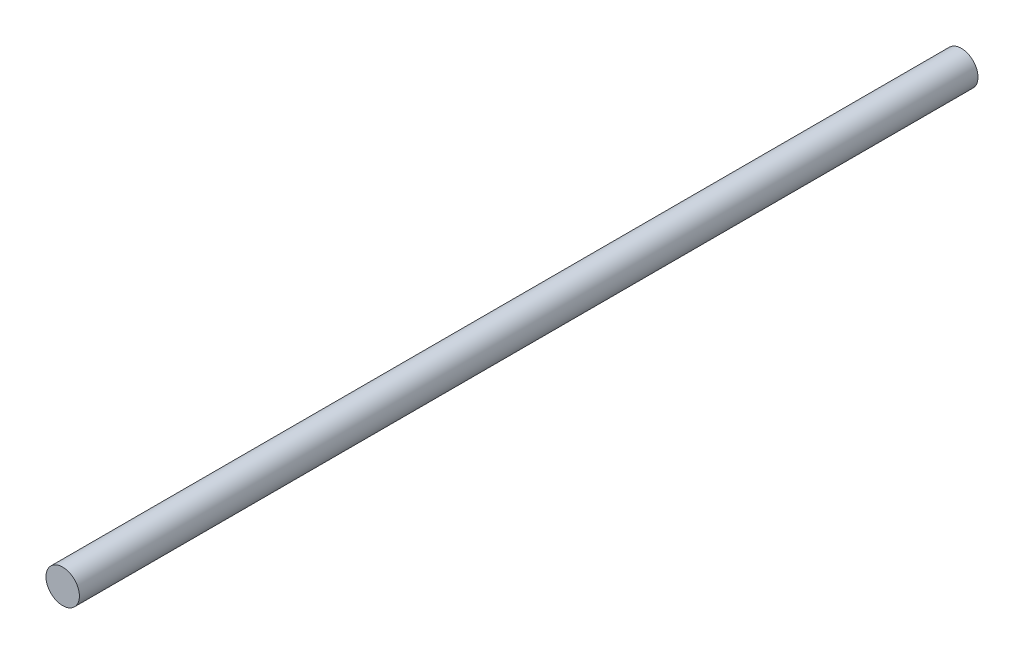
ISO-10303-21;
HEADER;
FILE_DESCRIPTION(('STEP AP214'),'2;1');
FILE_NAME('part.step','',(''),(''),'','','');
FILE_SCHEMA(('AUTOMOTIVE_DESIGN { 1 0 10303 214 1 1 1 1 }'));
ENDSEC;
DATA;
#1=APPLICATION_CONTEXT('core data for automotive mechanical design processes');
#2=APPLICATION_PROTOCOL_DEFINITION('international standard','automotive_design',2000,#1);
#3=PRODUCT_CONTEXT('',#1,'mechanical');
#4=PRODUCT('Part','Part','',(#3));
#5=PRODUCT_RELATED_PRODUCT_CATEGORY('part','',(#4));
#6=PRODUCT_DEFINITION_FORMATION('','',#4);
#7=PRODUCT_DEFINITION_CONTEXT('part definition',#1,'design');
#8=PRODUCT_DEFINITION('design','',#6,#7);
#9=PRODUCT_DEFINITION_SHAPE('','',#8);
#10=(LENGTH_UNIT() NAMED_UNIT(*) SI_UNIT(.MILLI.,.METRE.));
#11=(NAMED_UNIT(*) PLANE_ANGLE_UNIT() SI_UNIT($,.RADIAN.));
#12=(NAMED_UNIT(*) SI_UNIT($,.STERADIAN.) SOLID_ANGLE_UNIT());
#13=UNCERTAINTY_MEASURE_WITH_UNIT(LENGTH_MEASURE(1.E-05),#10,'distance_accuracy_value','');
#14=(GEOMETRIC_REPRESENTATION_CONTEXT(3) GLOBAL_UNCERTAINTY_ASSIGNED_CONTEXT((#13)) GLOBAL_UNIT_ASSIGNED_CONTEXT((#10,
#11,#12)) REPRESENTATION_CONTEXT('',''));
#15=CARTESIAN_POINT('',(0.,0.,0.));
#16=DIRECTION('',(0.,0.,1.));
#17=DIRECTION('',(1.,0.,0.));
#18=AXIS2_PLACEMENT_3D('',#15,#16,#17);
#19=CARTESIAN_POINT('',(0.,0.,215.));
#20=DIRECTION('',(0.,0.,-1.));
#21=DIRECTION('',(-1.,0.,0.));
#22=AXIS2_PLACEMENT_3D('',#19,#20,#21);
#23=CYLINDRICAL_SURFACE('',#22,4.);
#24=CARTESIAN_POINT('',(0.,0.,215.));
#25=DIRECTION('',(0.,0.,1.));
#26=DIRECTION('',(1.,0.,0.));
#27=AXIS2_PLACEMENT_3D('',#24,#25,#26);
#28=CIRCLE('',#27,4.);
#29=CARTESIAN_POINT('',(4.,0.,215.));
#30=VERTEX_POINT('',#29);
#31=EDGE_CURVE('E11',#30,#30,#28,.T.);
#32=ORIENTED_EDGE('',*,*,#31,.F.);
#33=EDGE_LOOP('',(#32));
#34=FACE_BOUND('',#33,.T.);
#35=CARTESIAN_POINT('',(0.,0.,0.));
#36=DIRECTION('',(0.,0.,1.));
#37=DIRECTION('',(1.,0.,0.));
#38=AXIS2_PLACEMENT_3D('',#35,#36,#37);
#39=CIRCLE('',#38,4.);
#40=CARTESIAN_POINT('',(4.,0.,0.));
#41=VERTEX_POINT('',#40);
#42=EDGE_CURVE('E50',#41,#41,#39,.T.);
#43=ORIENTED_EDGE('',*,*,#42,.T.);
#44=EDGE_LOOP('',(#43));
#45=FACE_BOUND('',#44,.T.);
#46=ADVANCED_FACE('F47',(#34,#45),#23,.T.);
#47=CARTESIAN_POINT('',(0.,0.,215.));
#48=DIRECTION('',(0.,0.,1.));
#49=DIRECTION('',(1.,0.,0.));
#50=AXIS2_PLACEMENT_3D('',#47,#48,#49);
#51=PLANE('',#50);
#52=ORIENTED_EDGE('',*,*,#31,.T.);
#53=EDGE_LOOP('',(#52));
#54=FACE_BOUND('',#53,.T.);
#55=ADVANCED_FACE('F76',(#54),#51,.T.);
#56=CARTESIAN_POINT('',(0.,0.,0.));
#57=DIRECTION('',(0.,0.,1.));
#58=DIRECTION('',(1.,0.,0.));
#59=AXIS2_PLACEMENT_3D('',#56,#57,#58);
#60=PLANE('',#59);
#61=CARTESIAN_POINT('',(0.,0.,0.));
#62=DIRECTION('',(0.,0.,-1.));
#63=DIRECTION('',(-1.,0.,0.));
#64=AXIS2_PLACEMENT_3D('',#61,#62,#63);
#65=CIRCLE('',#64,1.64999999999999);
#66=CARTESIAN_POINT('',(-1.64999999999999,0.,0.));
#67=VERTEX_POINT('',#66);
#68=EDGE_CURVE('E66',#67,#67,#65,.T.);
#69=ORIENTED_EDGE('',*,*,#68,.F.);
#70=EDGE_LOOP('',(#69));
#71=FACE_BOUND('',#70,.T.);
#72=ORIENTED_EDGE('',*,*,#42,.F.);
#73=EDGE_LOOP('',(#72));
#74=FACE_BOUND('',#73,.T.);
#75=ADVANCED_FACE('F60',(#71,#74),#60,.F.);
#76=CARTESIAN_POINT('',(0.,0.,10.1));
#77=DIRECTION('',(0.,0.,-1.));
#78=DIRECTION('',(-1.,0.,0.));
#79=AXIS2_PLACEMENT_3D('',#76,#77,#78);
#80=CONICAL_SURFACE('',#79,1.64999999999999,1.02974425867665);
#81=CARTESIAN_POINT('',(0.,0.,11.0914200213955));
#82=VERTEX_POINT('',#81);
#83=VERTEX_LOOP('',#82);
#84=FACE_BOUND('',#83,.T.);
#85=CARTESIAN_POINT('',(0.,0.,10.1));
#86=DIRECTION('',(0.,0.,-1.));
#87=DIRECTION('',(-1.,0.,0.));
#88=AXIS2_PLACEMENT_3D('',#85,#86,#87);
#89=CIRCLE('',#88,1.64999999999999);
#90=CARTESIAN_POINT('',(-1.64999999999999,0.,10.1));
#91=VERTEX_POINT('',#90);
#92=EDGE_CURVE('E64',#91,#91,#89,.T.);
#93=ORIENTED_EDGE('',*,*,#92,.T.);
#94=EDGE_LOOP('',(#93));
#95=FACE_BOUND('',#94,.T.);
#96=ADVANCED_FACE('F56',(#84,#95),#80,.F.);
#97=CARTESIAN_POINT('',(0.,0.,0.));
#98=DIRECTION('',(0.,0.,-1.));
#99=DIRECTION('',(-1.,0.,0.));
#100=AXIS2_PLACEMENT_3D('',#97,#98,#99);
#101=CYLINDRICAL_SURFACE('',#100,1.64999999999999);
#102=ORIENTED_EDGE('',*,*,#92,.F.);
#103=EDGE_LOOP('',(#102));
#104=FACE_BOUND('',#103,.T.);
#105=ORIENTED_EDGE('',*,*,#68,.T.);
#106=EDGE_LOOP('',(#105));
#107=FACE_BOUND('',#106,.T.);
#108=ADVANCED_FACE('F59',(#104,#107),#101,.F.);
#109=CLOSED_SHELL('',(#46,#55,#75,#96,#108));
#110=MANIFOLD_SOLID_BREP('B2',#109);
#111=ADVANCED_BREP_SHAPE_REPRESENTATION('',(#18,#110),#14);
#112=SHAPE_DEFINITION_REPRESENTATION(#9,#111);
ENDSEC;
END-ISO-10303-21;
